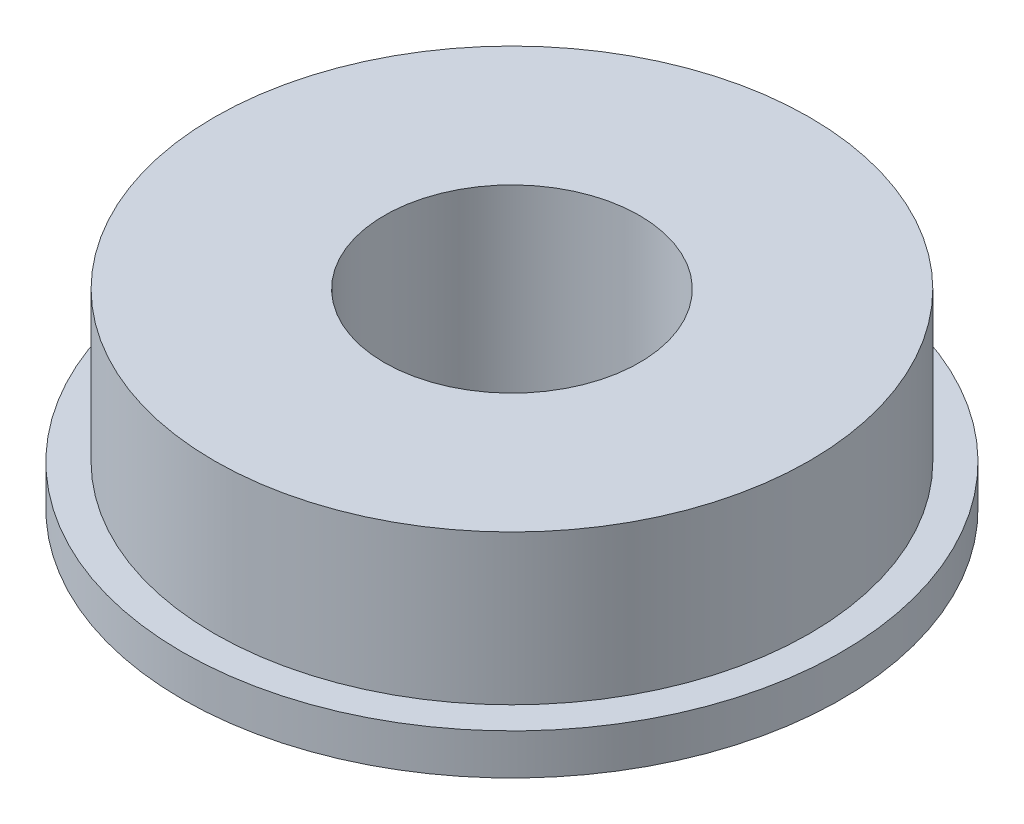
ISO-10303-21;
HEADER;
FILE_DESCRIPTION(('STEP AP214'),'2;1');
FILE_NAME('part.step','',(''),(''),'','','');
FILE_SCHEMA(('AUTOMOTIVE_DESIGN { 1 0 10303 214 1 1 1 1 }'));
ENDSEC;
DATA;
#1=APPLICATION_CONTEXT('core data for automotive mechanical design processes');
#2=APPLICATION_PROTOCOL_DEFINITION('international standard','automotive_design',2000,#1);
#3=PRODUCT_CONTEXT('',#1,'mechanical');
#4=PRODUCT('Part','Part','',(#3));
#5=PRODUCT_RELATED_PRODUCT_CATEGORY('part','',(#4));
#6=PRODUCT_DEFINITION_FORMATION('','',#4);
#7=PRODUCT_DEFINITION_CONTEXT('part definition',#1,'design');
#8=PRODUCT_DEFINITION('design','',#6,#7);
#9=PRODUCT_DEFINITION_SHAPE('','',#8);
#10=(LENGTH_UNIT() NAMED_UNIT(*) SI_UNIT(.MILLI.,.METRE.));
#11=(NAMED_UNIT(*) PLANE_ANGLE_UNIT() SI_UNIT($,.RADIAN.));
#12=(NAMED_UNIT(*) SI_UNIT($,.STERADIAN.) SOLID_ANGLE_UNIT());
#13=UNCERTAINTY_MEASURE_WITH_UNIT(LENGTH_MEASURE(1.E-05),#10,'distance_accuracy_value','');
#14=(GEOMETRIC_REPRESENTATION_CONTEXT(3) GLOBAL_UNCERTAINTY_ASSIGNED_CONTEXT((#13)) GLOBAL_UNIT_ASSIGNED_CONTEXT((#10,
#11,#12)) REPRESENTATION_CONTEXT('',''));
#15=CARTESIAN_POINT('',(0.,0.,0.));
#16=DIRECTION('',(0.,0.,1.));
#17=DIRECTION('',(1.,0.,0.));
#18=AXIS2_PLACEMENT_3D('',#15,#16,#17);
#19=CARTESIAN_POINT('',(0.,1.524,0.));
#20=DIRECTION('',(0.,1.,0.));
#21=DIRECTION('',(0.,0.,1.));
#22=AXIS2_PLACEMENT_3D('',#19,#20,#21);
#23=PLANE('',#22);
#24=CARTESIAN_POINT('',(0.,1.524,0.));
#25=DIRECTION('',(0.,1.,0.));
#26=DIRECTION('',(0.,0.,1.));
#27=AXIS2_PLACEMENT_3D('',#24,#25,#26);
#28=CIRCLE('',#27,12.3063);
#29=CARTESIAN_POINT('',(0.,1.524,12.3063));
#30=VERTEX_POINT('',#29);
#31=EDGE_CURVE('E10',#30,#30,#28,.T.);
#32=ORIENTED_EDGE('',*,*,#31,.T.);
#33=EDGE_LOOP('',(#32));
#34=FACE_BOUND('',#33,.T.);
#35=CARTESIAN_POINT('',(0.,1.524,0.));
#36=DIRECTION('',(0.,1.,0.));
#37=DIRECTION('',(0.,0.,1.));
#38=AXIS2_PLACEMENT_3D('',#35,#36,#37);
#39=CIRCLE('',#38,11.1125);
#40=CARTESIAN_POINT('',(0.,1.524,11.1125));
#41=VERTEX_POINT('',#40);
#42=EDGE_CURVE('E43',#41,#41,#39,.T.);
#43=ORIENTED_EDGE('',*,*,#42,.F.);
#44=EDGE_LOOP('',(#43));
#45=FACE_BOUND('',#44,.T.);
#46=ADVANCED_FACE('F30',(#34,#45),#23,.T.);
#47=CARTESIAN_POINT('',(0.,1.524,0.));
#48=DIRECTION('',(0.,-1.,0.));
#49=DIRECTION('',(0.,0.,-1.));
#50=AXIS2_PLACEMENT_3D('',#47,#48,#49);
#51=CYLINDRICAL_SURFACE('',#50,12.3063);
#52=ORIENTED_EDGE('',*,*,#31,.F.);
#53=EDGE_LOOP('',(#52));
#54=FACE_BOUND('',#53,.T.);
#55=CARTESIAN_POINT('',(0.,0.,0.));
#56=DIRECTION('',(0.,1.,0.));
#57=DIRECTION('',(0.,0.,1.));
#58=AXIS2_PLACEMENT_3D('',#55,#56,#57);
#59=CIRCLE('',#58,12.3063);
#60=CARTESIAN_POINT('',(0.,0.,12.3063));
#61=VERTEX_POINT('',#60);
#62=EDGE_CURVE('E34',#61,#61,#59,.T.);
#63=ORIENTED_EDGE('',*,*,#62,.T.);
#64=EDGE_LOOP('',(#63));
#65=FACE_BOUND('',#64,.T.);
#66=ADVANCED_FACE('F32',(#54,#65),#51,.T.);
#67=CARTESIAN_POINT('',(0.,0.,0.));
#68=DIRECTION('',(0.,1.,0.));
#69=DIRECTION('',(0.,0.,1.));
#70=AXIS2_PLACEMENT_3D('',#67,#68,#69);
#71=PLANE('',#70);
#72=CARTESIAN_POINT('',(0.,0.,0.));
#73=DIRECTION('',(0.,1.,0.));
#74=DIRECTION('',(0.,0.,1.));
#75=AXIS2_PLACEMENT_3D('',#72,#73,#74);
#76=CIRCLE('',#75,4.7625);
#77=CARTESIAN_POINT('',(0.,0.,4.7625));
#78=VERTEX_POINT('',#77);
#79=EDGE_CURVE('E46',#78,#78,#76,.T.);
#80=ORIENTED_EDGE('',*,*,#79,.T.);
#81=EDGE_LOOP('',(#80));
#82=FACE_BOUND('',#81,.T.);
#83=ORIENTED_EDGE('',*,*,#62,.F.);
#84=EDGE_LOOP('',(#83));
#85=FACE_BOUND('',#84,.T.);
#86=ADVANCED_FACE('F55',(#82,#85),#71,.F.);
#87=CARTESIAN_POINT('',(0.,7.112,0.));
#88=DIRECTION('',(0.,-1.,0.));
#89=DIRECTION('',(0.,0.,-1.));
#90=AXIS2_PLACEMENT_3D('',#87,#88,#89);
#91=CYLINDRICAL_SURFACE('',#90,11.1125);
#92=CARTESIAN_POINT('',(0.,7.112,0.));
#93=DIRECTION('',(0.,1.,0.));
#94=DIRECTION('',(0.,0.,1.));
#95=AXIS2_PLACEMENT_3D('',#92,#93,#94);
#96=CIRCLE('',#95,11.1125);
#97=CARTESIAN_POINT('',(0.,7.112,11.1125));
#98=VERTEX_POINT('',#97);
#99=EDGE_CURVE('E41',#98,#98,#96,.T.);
#100=ORIENTED_EDGE('',*,*,#99,.F.);
#101=EDGE_LOOP('',(#100));
#102=FACE_BOUND('',#101,.T.);
#103=ORIENTED_EDGE('',*,*,#42,.T.);
#104=EDGE_LOOP('',(#103));
#105=FACE_BOUND('',#104,.T.);
#106=ADVANCED_FACE('F67',(#102,#105),#91,.T.);
#107=CARTESIAN_POINT('',(0.,7.112,0.));
#108=DIRECTION('',(0.,1.,0.));
#109=DIRECTION('',(0.,0.,1.));
#110=AXIS2_PLACEMENT_3D('',#107,#108,#109);
#111=PLANE('',#110);
#112=CARTESIAN_POINT('',(0.,7.112,0.));
#113=DIRECTION('',(0.,1.,0.));
#114=DIRECTION('',(0.,0.,1.));
#115=AXIS2_PLACEMENT_3D('',#112,#113,#114);
#116=CIRCLE('',#115,4.7625);
#117=CARTESIAN_POINT('',(0.,7.112,4.7625));
#118=VERTEX_POINT('',#117);
#119=EDGE_CURVE('E49',#118,#118,#116,.T.);
#120=ORIENTED_EDGE('',*,*,#119,.F.);
#121=EDGE_LOOP('',(#120));
#122=FACE_BOUND('',#121,.T.);
#123=ORIENTED_EDGE('',*,*,#99,.T.);
#124=EDGE_LOOP('',(#123));
#125=FACE_BOUND('',#124,.T.);
#126=ADVANCED_FACE('F61',(#122,#125),#111,.T.);
#127=CARTESIAN_POINT('',(0.,0.,0.));
#128=DIRECTION('',(0.,1.,0.));
#129=DIRECTION('',(0.,0.,1.));
#130=AXIS2_PLACEMENT_3D('',#127,#128,#129);
#131=CYLINDRICAL_SURFACE('',#130,4.7625);
#132=ORIENTED_EDGE('',*,*,#79,.F.);
#133=EDGE_LOOP('',(#132));
#134=FACE_BOUND('',#133,.T.);
#135=ORIENTED_EDGE('',*,*,#119,.T.);
#136=EDGE_LOOP('',(#135));
#137=FACE_BOUND('',#136,.T.);
#138=ADVANCED_FACE('F58',(#134,#137),#131,.F.);
#139=CLOSED_SHELL('',(#46,#66,#86,#106,#126,#138));
#140=MANIFOLD_SOLID_BREP('B2',#139);
#141=ADVANCED_BREP_SHAPE_REPRESENTATION('',(#18,#140),#14);
#142=SHAPE_DEFINITION_REPRESENTATION(#9,#141);
ENDSEC;
END-ISO-10303-21;
